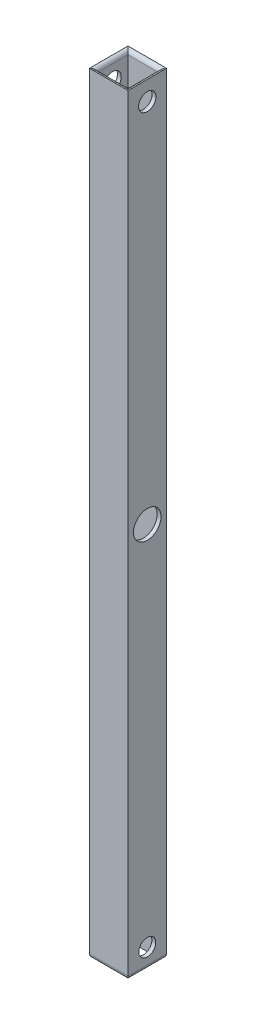
ISO-10303-21;
HEADER;
FILE_DESCRIPTION(('STEP AP214'),'2;1');
FILE_NAME('part.step','',(''),(''),'','','');
FILE_SCHEMA(('AUTOMOTIVE_DESIGN { 1 0 10303 214 1 1 1 1 }'));
ENDSEC;
DATA;
#1=APPLICATION_CONTEXT('core data for automotive mechanical design processes');
#2=APPLICATION_PROTOCOL_DEFINITION('international standard','automotive_design',2000,#1);
#3=PRODUCT_CONTEXT('',#1,'mechanical');
#4=PRODUCT('Part','Part','',(#3));
#5=PRODUCT_RELATED_PRODUCT_CATEGORY('part','',(#4));
#6=PRODUCT_DEFINITION_FORMATION('','',#4);
#7=PRODUCT_DEFINITION_CONTEXT('part definition',#1,'design');
#8=PRODUCT_DEFINITION('design','',#6,#7);
#9=PRODUCT_DEFINITION_SHAPE('','',#8);
#10=(LENGTH_UNIT() NAMED_UNIT(*) SI_UNIT(.MILLI.,.METRE.));
#11=(NAMED_UNIT(*) PLANE_ANGLE_UNIT() SI_UNIT($,.RADIAN.));
#12=(NAMED_UNIT(*) SI_UNIT($,.STERADIAN.) SOLID_ANGLE_UNIT());
#13=UNCERTAINTY_MEASURE_WITH_UNIT(LENGTH_MEASURE(1.E-05),#10,'distance_accuracy_value','');
#14=(GEOMETRIC_REPRESENTATION_CONTEXT(3) GLOBAL_UNCERTAINTY_ASSIGNED_CONTEXT((#13)) GLOBAL_UNIT_ASSIGNED_CONTEXT((#10,
#11,#12)) REPRESENTATION_CONTEXT('',''));
#15=CARTESIAN_POINT('',(0.,0.,0.));
#16=DIRECTION('',(0.,0.,1.));
#17=DIRECTION('',(1.,0.,0.));
#18=AXIS2_PLACEMENT_3D('',#15,#16,#17);
#19=CARTESIAN_POINT('',(5.,200.,-5.));
#20=DIRECTION('',(-1.,0.,0.));
#21=DIRECTION('',(0.,0.,1.));
#22=AXIS2_PLACEMENT_3D('',#19,#20,#21);
#23=PLANE('',#22);
#24=CARTESIAN_POINT('',(5.,195.,0.));
#25=DIRECTION('',(1.,0.,0.));
#26=DIRECTION('',(0.,0.,-1.));
#27=AXIS2_PLACEMENT_3D('',#24,#25,#26);
#28=CIRCLE('',#27,2.25);
#29=CARTESIAN_POINT('',(5.,195.,-2.25));
#30=VERTEX_POINT('',#29);
#31=EDGE_CURVE('E587',#30,#30,#28,.T.);
#32=ORIENTED_EDGE('',*,*,#31,.F.);
#33=EDGE_LOOP('',(#32));
#34=FACE_BOUND('',#33,.T.);
#35=CARTESIAN_POINT('',(5.,5.,0.));
#36=DIRECTION('',(1.,0.,0.));
#37=DIRECTION('',(0.,0.,-1.));
#38=AXIS2_PLACEMENT_3D('',#35,#36,#37);
#39=CIRCLE('',#38,2.2);
#40=CARTESIAN_POINT('',(5.,5.,-2.2));
#41=VERTEX_POINT('',#40);
#42=EDGE_CURVE('E555',#41,#41,#39,.T.);
#43=ORIENTED_EDGE('',*,*,#42,.F.);
#44=EDGE_LOOP('',(#43));
#45=FACE_BOUND('',#44,.T.);
#46=CARTESIAN_POINT('',(5.,100.,0.));
#47=DIRECTION('',(1.,0.,0.));
#48=DIRECTION('',(0.,0.,-1.));
#49=AXIS2_PLACEMENT_3D('',#46,#47,#48);
#50=CIRCLE('',#49,3.575);
#51=CARTESIAN_POINT('',(5.,100.,-3.575));
#52=VERTEX_POINT('',#51);
#53=EDGE_CURVE('E550',#52,#52,#50,.T.);
#54=ORIENTED_EDGE('',*,*,#53,.F.);
#55=EDGE_LOOP('',(#54));
#56=FACE_BOUND('',#55,.T.);
#57=DIRECTION('',(0.,-1.,0.));
#58=VECTOR('',#57,1.);
#59=CARTESIAN_POINT('',(5.,200.,5.));
#60=LINE('',#59,#58);
#61=CARTESIAN_POINT('',(5.,200.,5.));
#62=VERTEX_POINT('',#61);
#63=CARTESIAN_POINT('',(5.,1.,5.));
#64=VERTEX_POINT('',#63);
#65=EDGE_CURVE('E208',#62,#64,#60,.T.);
#66=ORIENTED_EDGE('',*,*,#65,.T.);
#67=DIRECTION('',(0.,0.,-1.));
#68=VECTOR('',#67,1.);
#69=CARTESIAN_POINT('',(5.,1.,-5.));
#70=LINE('',#69,#68);
#71=CARTESIAN_POINT('',(5.,1.,-5.));
#72=VERTEX_POINT('',#71);
#73=EDGE_CURVE('E228',#64,#72,#70,.T.);
#74=ORIENTED_EDGE('',*,*,#73,.T.);
#75=DIRECTION('',(0.,-1.,0.));
#76=VECTOR('',#75,1.);
#77=CARTESIAN_POINT('',(5.,200.,-5.));
#78=LINE('',#77,#76);
#79=CARTESIAN_POINT('',(5.,200.,-5.));
#80=VERTEX_POINT('',#79);
#81=EDGE_CURVE('E224',#80,#72,#78,.T.);
#82=ORIENTED_EDGE('',*,*,#81,.F.);
#83=DIRECTION('',(0.,0.,-1.));
#84=VECTOR('',#83,1.);
#85=CARTESIAN_POINT('',(5.,200.,-5.));
#86=LINE('',#85,#84);
#87=EDGE_CURVE('E210',#62,#80,#86,.T.);
#88=ORIENTED_EDGE('',*,*,#87,.F.);
#89=EDGE_LOOP('',(#66,#74,#82,#88));
#90=FACE_BOUND('',#89,.T.);
#91=ADVANCED_FACE('F54',(#34,#45,#56,#90),#23,.F.);
#92=CARTESIAN_POINT('',(-5.,200.,-5.));
#93=DIRECTION('',(0.,0.,1.));
#94=DIRECTION('',(1.,0.,0.));
#95=AXIS2_PLACEMENT_3D('',#92,#93,#94);
#96=PLANE('',#95);
#97=ORIENTED_EDGE('',*,*,#81,.T.);
#98=DIRECTION('',(-1.,0.,0.));
#99=VECTOR('',#98,1.);
#100=CARTESIAN_POINT('',(-5.,1.,-5.));
#101=LINE('',#100,#99);
#102=CARTESIAN_POINT('',(-5.,1.,-5.));
#103=VERTEX_POINT('',#102);
#104=EDGE_CURVE('E157',#72,#103,#101,.T.);
#105=ORIENTED_EDGE('',*,*,#104,.T.);
#106=DIRECTION('',(0.,-1.,0.));
#107=VECTOR('',#106,1.);
#108=CARTESIAN_POINT('',(-5.,200.,-5.));
#109=LINE('',#108,#107);
#110=CARTESIAN_POINT('',(-5.,200.,-5.));
#111=VERTEX_POINT('',#110);
#112=EDGE_CURVE('E221',#111,#103,#109,.T.);
#113=ORIENTED_EDGE('',*,*,#112,.F.);
#114=DIRECTION('',(-1.,0.,0.));
#115=VECTOR('',#114,1.);
#116=CARTESIAN_POINT('',(-5.,200.,-5.));
#117=LINE('',#116,#115);
#118=EDGE_CURVE('E203',#80,#111,#117,.T.);
#119=ORIENTED_EDGE('',*,*,#118,.F.);
#120=EDGE_LOOP('',(#97,#105,#113,#119));
#121=FACE_BOUND('',#120,.T.);
#122=ADVANCED_FACE('F275',(#121),#96,.F.);
#123=CARTESIAN_POINT('',(-5.,200.,-5.));
#124=DIRECTION('',(1.,0.,0.));
#125=DIRECTION('',(0.,0.,-1.));
#126=AXIS2_PLACEMENT_3D('',#123,#124,#125);
#127=PLANE('',#126);
#128=CARTESIAN_POINT('',(-5.,195.,0.));
#129=DIRECTION('',(1.,0.,0.));
#130=DIRECTION('',(0.,0.,-1.));
#131=AXIS2_PLACEMENT_3D('',#128,#129,#130);
#132=CIRCLE('',#131,2.25);
#133=CARTESIAN_POINT('',(-5.,195.,-2.25));
#134=VERTEX_POINT('',#133);
#135=EDGE_CURVE('E176',#134,#134,#132,.T.);
#136=ORIENTED_EDGE('',*,*,#135,.T.);
#137=EDGE_LOOP('',(#136));
#138=FACE_BOUND('',#137,.T.);
#139=CARTESIAN_POINT('',(-5.,5.,0.));
#140=DIRECTION('',(1.,0.,0.));
#141=DIRECTION('',(0.,0.,-1.));
#142=AXIS2_PLACEMENT_3D('',#139,#140,#141);
#143=CIRCLE('',#142,2.2);
#144=CARTESIAN_POINT('',(-5.,5.,-2.2));
#145=VERTEX_POINT('',#144);
#146=EDGE_CURVE('E582',#145,#145,#143,.T.);
#147=ORIENTED_EDGE('',*,*,#146,.T.);
#148=EDGE_LOOP('',(#147));
#149=FACE_BOUND('',#148,.T.);
#150=CARTESIAN_POINT('',(-5.,100.,0.));
#151=DIRECTION('',(1.,0.,0.));
#152=DIRECTION('',(0.,0.,-1.));
#153=AXIS2_PLACEMENT_3D('',#150,#151,#152);
#154=CIRCLE('',#153,3.575);
#155=CARTESIAN_POINT('',(-5.,100.,-3.575));
#156=VERTEX_POINT('',#155);
#157=EDGE_CURVE('E234',#156,#156,#154,.T.);
#158=ORIENTED_EDGE('',*,*,#157,.T.);
#159=EDGE_LOOP('',(#158));
#160=FACE_BOUND('',#159,.T.);
#161=ORIENTED_EDGE('',*,*,#112,.T.);
#162=DIRECTION('',(0.,0.,1.));
#163=VECTOR('',#162,1.);
#164=CARTESIAN_POINT('',(-5.,1.,-5.));
#165=LINE('',#164,#163);
#166=CARTESIAN_POINT('',(-5.,1.,5.));
#167=VERTEX_POINT('',#166);
#168=EDGE_CURVE('E248',#103,#167,#165,.T.);
#169=ORIENTED_EDGE('',*,*,#168,.T.);
#170=DIRECTION('',(0.,-1.,0.));
#171=VECTOR('',#170,1.);
#172=CARTESIAN_POINT('',(-5.,200.,5.));
#173=LINE('',#172,#171);
#174=CARTESIAN_POINT('',(-5.,200.,5.));
#175=VERTEX_POINT('',#174);
#176=EDGE_CURVE('E217',#175,#167,#173,.T.);
#177=ORIENTED_EDGE('',*,*,#176,.F.);
#178=DIRECTION('',(0.,0.,1.));
#179=VECTOR('',#178,1.);
#180=CARTESIAN_POINT('',(-5.,200.,-5.));
#181=LINE('',#180,#179);
#182=EDGE_CURVE('E198',#111,#175,#181,.T.);
#183=ORIENTED_EDGE('',*,*,#182,.F.);
#184=EDGE_LOOP('',(#161,#169,#177,#183));
#185=FACE_BOUND('',#184,.T.);
#186=ADVANCED_FACE('F303',(#138,#149,#160,#185),#127,.F.);
#187=CARTESIAN_POINT('',(-5.,200.,5.));
#188=DIRECTION('',(0.,0.,-1.));
#189=DIRECTION('',(-1.,0.,0.));
#190=AXIS2_PLACEMENT_3D('',#187,#188,#189);
#191=PLANE('',#190);
#192=ORIENTED_EDGE('',*,*,#176,.T.);
#193=DIRECTION('',(1.,0.,0.));
#194=VECTOR('',#193,1.);
#195=CARTESIAN_POINT('',(-5.,1.,5.));
#196=LINE('',#195,#194);
#197=EDGE_CURVE('E251',#167,#64,#196,.T.);
#198=ORIENTED_EDGE('',*,*,#197,.T.);
#199=ORIENTED_EDGE('',*,*,#65,.F.);
#200=DIRECTION('',(1.,0.,0.));
#201=VECTOR('',#200,1.);
#202=CARTESIAN_POINT('',(-5.,200.,5.));
#203=LINE('',#202,#201);
#204=EDGE_CURVE('E192',#175,#62,#203,.T.);
#205=ORIENTED_EDGE('',*,*,#204,.F.);
#206=EDGE_LOOP('',(#192,#198,#199,#205));
#207=FACE_BOUND('',#206,.T.);
#208=ADVANCED_FACE('F304',(#207),#191,.F.);
#209=CARTESIAN_POINT('',(4.,0.,0.));
#210=DIRECTION('',(-1.,0.,0.));
#211=DIRECTION('',(0.,0.,1.));
#212=AXIS2_PLACEMENT_3D('',#209,#210,#211);
#213=PLANE('',#212);
#214=CARTESIAN_POINT('',(4.,195.,0.));
#215=DIRECTION('',(-1.,0.,0.));
#216=DIRECTION('',(0.,0.,1.));
#217=AXIS2_PLACEMENT_3D('',#214,#215,#216);
#218=CIRCLE('',#217,2.25);
#219=CARTESIAN_POINT('',(4.,195.,2.25));
#220=VERTEX_POINT('',#219);
#221=EDGE_CURVE('E154',#220,#220,#218,.T.);
#222=ORIENTED_EDGE('',*,*,#221,.F.);
#223=EDGE_LOOP('',(#222));
#224=FACE_BOUND('',#223,.T.);
#225=CARTESIAN_POINT('',(4.,5.,0.));
#226=DIRECTION('',(-1.,0.,0.));
#227=DIRECTION('',(0.,0.,1.));
#228=AXIS2_PLACEMENT_3D('',#225,#226,#227);
#229=CIRCLE('',#228,2.2);
#230=CARTESIAN_POINT('',(4.,5.,2.2));
#231=VERTEX_POINT('',#230);
#232=EDGE_CURVE('E239',#231,#231,#229,.T.);
#233=ORIENTED_EDGE('',*,*,#232,.F.);
#234=EDGE_LOOP('',(#233));
#235=FACE_BOUND('',#234,.T.);
#236=CARTESIAN_POINT('',(4.,100.,0.));
#237=DIRECTION('',(-1.,0.,0.));
#238=DIRECTION('',(0.,0.,1.));
#239=AXIS2_PLACEMENT_3D('',#236,#237,#238);
#240=CIRCLE('',#239,3.575);
#241=CARTESIAN_POINT('',(4.,100.,3.575));
#242=VERTEX_POINT('',#241);
#243=EDGE_CURVE('E233',#242,#242,#240,.T.);
#244=ORIENTED_EDGE('',*,*,#243,.F.);
#245=EDGE_LOOP('',(#244));
#246=FACE_BOUND('',#245,.T.);
#247=DIRECTION('',(0.,1.,0.));
#248=VECTOR('',#247,1.);
#249=CARTESIAN_POINT('',(4.,0.,4.));
#250=LINE('',#249,#248);
#251=CARTESIAN_POINT('',(4.,0.,4.));
#252=VERTEX_POINT('',#251);
#253=CARTESIAN_POINT('',(4.,199.,4.));
#254=VERTEX_POINT('',#253);
#255=EDGE_CURVE('E262',#252,#254,#250,.T.);
#256=ORIENTED_EDGE('',*,*,#255,.T.);
#257=DIRECTION('',(0.,0.,1.));
#258=VECTOR('',#257,1.);
#259=CARTESIAN_POINT('',(4.,199.,0.));
#260=LINE('',#259,#258);
#261=CARTESIAN_POINT('',(4.,199.,-4.));
#262=VERTEX_POINT('',#261);
#263=EDGE_CURVE('E141',#254,#262,#260,.F.);
#264=ORIENTED_EDGE('',*,*,#263,.T.);
#265=DIRECTION('',(0.,1.,0.));
#266=VECTOR('',#265,1.);
#267=CARTESIAN_POINT('',(4.,0.,-4.));
#268=LINE('',#267,#266);
#269=CARTESIAN_POINT('',(4.,0.,-4.));
#270=VERTEX_POINT('',#269);
#271=EDGE_CURVE('E123',#270,#262,#268,.T.);
#272=ORIENTED_EDGE('',*,*,#271,.F.);
#273=DIRECTION('',(0.,0.,1.));
#274=VECTOR('',#273,1.);
#275=CARTESIAN_POINT('',(4.,0.,0.));
#276=LINE('',#275,#274);
#277=EDGE_CURVE('E131',#270,#252,#276,.T.);
#278=ORIENTED_EDGE('',*,*,#277,.T.);
#279=EDGE_LOOP('',(#256,#264,#272,#278));
#280=FACE_BOUND('',#279,.T.);
#281=ADVANCED_FACE('F138',(#224,#235,#246,#280),#213,.T.);
#282=CARTESIAN_POINT('',(0.,0.,4.));
#283=DIRECTION('',(0.,0.,1.));
#284=DIRECTION('',(1.,0.,0.));
#285=AXIS2_PLACEMENT_3D('',#282,#283,#284);
#286=PLANE('',#285);
#287=DIRECTION('',(0.,1.,0.));
#288=VECTOR('',#287,1.);
#289=CARTESIAN_POINT('',(-4.,0.,4.));
#290=LINE('',#289,#288);
#291=CARTESIAN_POINT('',(-4.,0.,4.));
#292=VERTEX_POINT('',#291);
#293=CARTESIAN_POINT('',(-4.,199.,4.));
#294=VERTEX_POINT('',#293);
#295=EDGE_CURVE('E263',#292,#294,#290,.T.);
#296=ORIENTED_EDGE('',*,*,#295,.T.);
#297=DIRECTION('',(1.,0.,0.));
#298=VECTOR('',#297,1.);
#299=CARTESIAN_POINT('',(4.,199.,4.));
#300=LINE('',#299,#298);
#301=EDGE_CURVE('E64',#294,#254,#300,.T.);
#302=ORIENTED_EDGE('',*,*,#301,.T.);
#303=ORIENTED_EDGE('',*,*,#255,.F.);
#304=DIRECTION('',(1.,0.,0.));
#305=VECTOR('',#304,1.);
#306=CARTESIAN_POINT('',(0.,0.,4.));
#307=LINE('',#306,#305);
#308=EDGE_CURVE('E143',#292,#252,#307,.T.);
#309=ORIENTED_EDGE('',*,*,#308,.F.);
#310=EDGE_LOOP('',(#296,#302,#303,#309));
#311=FACE_BOUND('',#310,.T.);
#312=ADVANCED_FACE('F260',(#311),#286,.F.);
#313=CARTESIAN_POINT('',(-4.,0.,0.));
#314=DIRECTION('',(-1.,0.,0.));
#315=DIRECTION('',(0.,0.,1.));
#316=AXIS2_PLACEMENT_3D('',#313,#314,#315);
#317=PLANE('',#316);
#318=CARTESIAN_POINT('',(-4.,195.,0.));
#319=DIRECTION('',(-1.,0.,0.));
#320=DIRECTION('',(0.,0.,1.));
#321=AXIS2_PLACEMENT_3D('',#318,#319,#320);
#322=CIRCLE('',#321,2.25);
#323=CARTESIAN_POINT('',(-4.,195.,2.25));
#324=VERTEX_POINT('',#323);
#325=EDGE_CURVE('E240',#324,#324,#322,.T.);
#326=ORIENTED_EDGE('',*,*,#325,.T.);
#327=EDGE_LOOP('',(#326));
#328=FACE_BOUND('',#327,.T.);
#329=CARTESIAN_POINT('',(-4.,5.,0.));
#330=DIRECTION('',(-1.,0.,0.));
#331=DIRECTION('',(0.,0.,1.));
#332=AXIS2_PLACEMENT_3D('',#329,#330,#331);
#333=CIRCLE('',#332,2.2);
#334=CARTESIAN_POINT('',(-4.,5.,2.2));
#335=VERTEX_POINT('',#334);
#336=EDGE_CURVE('E235',#335,#335,#333,.T.);
#337=ORIENTED_EDGE('',*,*,#336,.T.);
#338=EDGE_LOOP('',(#337));
#339=FACE_BOUND('',#338,.T.);
#340=CARTESIAN_POINT('',(-4.,100.,0.));
#341=DIRECTION('',(-1.,0.,0.));
#342=DIRECTION('',(0.,0.,1.));
#343=AXIS2_PLACEMENT_3D('',#340,#341,#342);
#344=CIRCLE('',#343,3.575);
#345=CARTESIAN_POINT('',(-4.,100.,3.575));
#346=VERTEX_POINT('',#345);
#347=EDGE_CURVE('E229',#346,#346,#344,.T.);
#348=ORIENTED_EDGE('',*,*,#347,.T.);
#349=EDGE_LOOP('',(#348));
#350=FACE_BOUND('',#349,.T.);
#351=DIRECTION('',(0.,1.,0.));
#352=VECTOR('',#351,1.);
#353=CARTESIAN_POINT('',(-4.,0.,-4.));
#354=LINE('',#353,#352);
#355=CARTESIAN_POINT('',(-4.,0.,-4.));
#356=VERTEX_POINT('',#355);
#357=CARTESIAN_POINT('',(-4.,199.,-4.));
#358=VERTEX_POINT('',#357);
#359=EDGE_CURVE('E124',#356,#358,#354,.T.);
#360=ORIENTED_EDGE('',*,*,#359,.T.);
#361=DIRECTION('',(0.,0.,1.));
#362=VECTOR('',#361,1.);
#363=CARTESIAN_POINT('',(-4.,199.,4.));
#364=LINE('',#363,#362);
#365=EDGE_CURVE('E77',#358,#294,#364,.T.);
#366=ORIENTED_EDGE('',*,*,#365,.T.);
#367=ORIENTED_EDGE('',*,*,#295,.F.);
#368=DIRECTION('',(0.,0.,1.));
#369=VECTOR('',#368,1.);
#370=CARTESIAN_POINT('',(-4.,0.,0.));
#371=LINE('',#370,#369);
#372=EDGE_CURVE('E130',#356,#292,#371,.T.);
#373=ORIENTED_EDGE('',*,*,#372,.F.);
#374=EDGE_LOOP('',(#360,#366,#367,#373));
#375=FACE_BOUND('',#374,.T.);
#376=ADVANCED_FACE('F299',(#328,#339,#350,#375),#317,.F.);
#377=CARTESIAN_POINT('',(0.,0.,-4.));
#378=DIRECTION('',(0.,0.,1.));
#379=DIRECTION('',(1.,0.,0.));
#380=AXIS2_PLACEMENT_3D('',#377,#378,#379);
#381=PLANE('',#380);
#382=ORIENTED_EDGE('',*,*,#271,.T.);
#383=DIRECTION('',(1.,0.,0.));
#384=VECTOR('',#383,1.);
#385=CARTESIAN_POINT('',(0.,199.,-4.));
#386=LINE('',#385,#384);
#387=EDGE_CURVE('E13',#262,#358,#386,.F.);
#388=ORIENTED_EDGE('',*,*,#387,.T.);
#389=ORIENTED_EDGE('',*,*,#359,.F.);
#390=DIRECTION('',(1.,0.,0.));
#391=VECTOR('',#390,1.);
#392=CARTESIAN_POINT('',(0.,0.,-4.));
#393=LINE('',#392,#391);
#394=EDGE_CURVE('E120',#356,#270,#393,.T.);
#395=ORIENTED_EDGE('',*,*,#394,.T.);
#396=EDGE_LOOP('',(#382,#388,#389,#395));
#397=FACE_BOUND('',#396,.T.);
#398=ADVANCED_FACE('F122',(#397),#381,.T.);
#399=CARTESIAN_POINT('',(-5.,100.,0.));
#400=DIRECTION('',(1.,0.,0.));
#401=DIRECTION('',(0.,0.,-1.));
#402=AXIS2_PLACEMENT_3D('',#399,#400,#401);
#403=CYLINDRICAL_SURFACE('',#402,3.575);
#404=ORIENTED_EDGE('',*,*,#157,.F.);
#405=EDGE_LOOP('',(#404));
#406=FACE_BOUND('',#405,.T.);
#407=ORIENTED_EDGE('',*,*,#347,.F.);
#408=EDGE_LOOP('',(#407));
#409=FACE_BOUND('',#408,.T.);
#410=ADVANCED_FACE('F386',(#406,#409),#403,.F.);
#411=CARTESIAN_POINT('',(-5.,5.,0.));
#412=DIRECTION('',(1.,0.,0.));
#413=DIRECTION('',(0.,0.,-1.));
#414=AXIS2_PLACEMENT_3D('',#411,#412,#413);
#415=CYLINDRICAL_SURFACE('',#414,2.2);
#416=ORIENTED_EDGE('',*,*,#146,.F.);
#417=EDGE_LOOP('',(#416));
#418=FACE_BOUND('',#417,.T.);
#419=ORIENTED_EDGE('',*,*,#336,.F.);
#420=EDGE_LOOP('',(#419));
#421=FACE_BOUND('',#420,.T.);
#422=ADVANCED_FACE('F378',(#418,#421),#415,.F.);
#423=CARTESIAN_POINT('',(-5.,195.,0.));
#424=DIRECTION('',(1.,0.,0.));
#425=DIRECTION('',(0.,0.,-1.));
#426=AXIS2_PLACEMENT_3D('',#423,#424,#425);
#427=CYLINDRICAL_SURFACE('',#426,2.25);
#428=ORIENTED_EDGE('',*,*,#135,.F.);
#429=EDGE_LOOP('',(#428));
#430=FACE_BOUND('',#429,.T.);
#431=ORIENTED_EDGE('',*,*,#325,.F.);
#432=EDGE_LOOP('',(#431));
#433=FACE_BOUND('',#432,.T.);
#434=ADVANCED_FACE('F369',(#430,#433),#427,.F.);
#435=ORIENTED_EDGE('',*,*,#243,.T.);
#436=EDGE_LOOP('',(#435));
#437=FACE_BOUND('',#436,.T.);
#438=ORIENTED_EDGE('',*,*,#53,.T.);
#439=EDGE_LOOP('',(#438));
#440=FACE_BOUND('',#439,.T.);
#441=ADVANCED_FACE('F375',(#437,#440),#403,.F.);
#442=ORIENTED_EDGE('',*,*,#232,.T.);
#443=EDGE_LOOP('',(#442));
#444=FACE_BOUND('',#443,.T.);
#445=ORIENTED_EDGE('',*,*,#42,.T.);
#446=EDGE_LOOP('',(#445));
#447=FACE_BOUND('',#446,.T.);
#448=ADVANCED_FACE('F366',(#444,#447),#415,.F.);
#449=ORIENTED_EDGE('',*,*,#221,.T.);
#450=EDGE_LOOP('',(#449));
#451=FACE_BOUND('',#450,.T.);
#452=ORIENTED_EDGE('',*,*,#31,.T.);
#453=EDGE_LOOP('',(#452));
#454=FACE_BOUND('',#453,.T.);
#455=ADVANCED_FACE('F333',(#451,#454),#427,.F.);
#456=CARTESIAN_POINT('',(-4.,1.,-5.));
#457=DIRECTION('',(0.,0.,1.));
#458=DIRECTION('',(1.,0.,0.));
#459=AXIS2_PLACEMENT_3D('',#456,#457,#458);
#460=CYLINDRICAL_SURFACE('',#459,1.);
#461=CARTESIAN_POINT('',(-4.,1.,-4.));
#462=DIRECTION('',(-0.707106781186547,0.,0.707106781186547));
#463=DIRECTION('',(0.707106781186547,0.,0.707106781186547));
#464=AXIS2_PLACEMENT_3D('',#461,#462,#463);
#465=ELLIPSE('',#464,1.41421356237309,1.);
#466=EDGE_CURVE('E164',#356,#103,#465,.F.);
#467=ORIENTED_EDGE('',*,*,#466,.F.);
#468=ORIENTED_EDGE('',*,*,#372,.T.);
#469=CARTESIAN_POINT('',(-4.,1.,4.));
#470=DIRECTION('',(0.707106781186547,0.,0.707106781186547));
#471=DIRECTION('',(0.707106781186547,0.,-0.707106781186547));
#472=AXIS2_PLACEMENT_3D('',#469,#470,#471);
#473=ELLIPSE('',#472,1.41421356237309,1.);
#474=EDGE_CURVE('E172',#167,#292,#473,.T.);
#475=ORIENTED_EDGE('',*,*,#474,.F.);
#476=ORIENTED_EDGE('',*,*,#168,.F.);
#477=EDGE_LOOP('',(#467,#468,#475,#476));
#478=FACE_BOUND('',#477,.T.);
#479=ADVANCED_FACE('F301',(#478),#460,.T.);
#480=CARTESIAN_POINT('',(-5.,1.,4.));
#481=DIRECTION('',(1.,0.,0.));
#482=DIRECTION('',(0.,0.,-1.));
#483=AXIS2_PLACEMENT_3D('',#480,#481,#482);
#484=CYLINDRICAL_SURFACE('',#483,1.);
#485=ORIENTED_EDGE('',*,*,#474,.T.);
#486=ORIENTED_EDGE('',*,*,#308,.T.);
#487=CARTESIAN_POINT('',(4.,1.,4.));
#488=DIRECTION('',(0.707106781186547,0.,-0.707106781186548));
#489=DIRECTION('',(0.707106781186547,0.,0.707106781186547));
#490=AXIS2_PLACEMENT_3D('',#487,#488,#489);
#491=ELLIPSE('',#490,1.4142135623731,1.);
#492=EDGE_CURVE('E151',#64,#252,#491,.T.);
#493=ORIENTED_EDGE('',*,*,#492,.F.);
#494=ORIENTED_EDGE('',*,*,#197,.F.);
#495=EDGE_LOOP('',(#485,#486,#493,#494));
#496=FACE_BOUND('',#495,.T.);
#497=ADVANCED_FACE('F280',(#496),#484,.T.);
#498=CARTESIAN_POINT('',(-5.,1.,-4.));
#499=DIRECTION('',(-1.,0.,0.));
#500=DIRECTION('',(0.,0.,1.));
#501=AXIS2_PLACEMENT_3D('',#498,#499,#500);
#502=CYLINDRICAL_SURFACE('',#501,1.);
#503=ORIENTED_EDGE('',*,*,#466,.T.);
#504=ORIENTED_EDGE('',*,*,#104,.F.);
#505=CARTESIAN_POINT('',(4.,1.,-4.));
#506=DIRECTION('',(-0.707106781186547,0.,-0.707106781186547));
#507=DIRECTION('',(-0.707106781186547,0.,0.707106781186548));
#508=AXIS2_PLACEMENT_3D('',#505,#506,#507);
#509=ELLIPSE('',#508,1.41421356237309,1.);
#510=EDGE_CURVE('E148',#270,#72,#509,.F.);
#511=ORIENTED_EDGE('',*,*,#510,.F.);
#512=ORIENTED_EDGE('',*,*,#394,.F.);
#513=EDGE_LOOP('',(#503,#504,#511,#512));
#514=FACE_BOUND('',#513,.T.);
#515=ADVANCED_FACE('F156',(#514),#502,.T.);
#516=CARTESIAN_POINT('',(4.,1.,-5.));
#517=DIRECTION('',(0.,0.,-1.));
#518=DIRECTION('',(-1.,0.,0.));
#519=AXIS2_PLACEMENT_3D('',#516,#517,#518);
#520=CYLINDRICAL_SURFACE('',#519,1.);
#521=ORIENTED_EDGE('',*,*,#492,.T.);
#522=ORIENTED_EDGE('',*,*,#277,.F.);
#523=ORIENTED_EDGE('',*,*,#510,.T.);
#524=ORIENTED_EDGE('',*,*,#73,.F.);
#525=EDGE_LOOP('',(#521,#522,#523,#524));
#526=FACE_BOUND('',#525,.T.);
#527=ADVANCED_FACE('F146',(#526),#520,.T.);
#528=CARTESIAN_POINT('',(-5.,199.,0.));
#529=DIRECTION('',(0.,0.,-1.));
#530=DIRECTION('',(-1.,0.,0.));
#531=AXIS2_PLACEMENT_3D('',#528,#529,#530);
#532=CYLINDRICAL_SURFACE('',#531,1.);
#533=CARTESIAN_POINT('',(-5.,199.,5.));
#534=DIRECTION('',(-0.707106781186548,0.,-0.707106781186547));
#535=DIRECTION('',(0.707106781186547,0.,-0.707106781186547));
#536=AXIS2_PLACEMENT_3D('',#533,#534,#535);
#537=ELLIPSE('',#536,1.4142135623731,1.);
#538=EDGE_CURVE('E167',#294,#175,#537,.F.);
#539=ORIENTED_EDGE('',*,*,#538,.F.);
#540=ORIENTED_EDGE('',*,*,#365,.F.);
#541=CARTESIAN_POINT('',(-5.,199.,-5.));
#542=DIRECTION('',(0.707106781186547,0.,-0.707106781186547));
#543=DIRECTION('',(-0.707106781186547,0.,-0.707106781186547));
#544=AXIS2_PLACEMENT_3D('',#541,#542,#543);
#545=ELLIPSE('',#544,1.41421356237309,1.);
#546=EDGE_CURVE('E58',#111,#358,#545,.T.);
#547=ORIENTED_EDGE('',*,*,#546,.F.);
#548=ORIENTED_EDGE('',*,*,#182,.T.);
#549=EDGE_LOOP('',(#539,#540,#547,#548));
#550=FACE_BOUND('',#549,.T.);
#551=ADVANCED_FACE('F56',(#550),#532,.T.);
#552=CARTESIAN_POINT('',(0.,199.,-5.));
#553=DIRECTION('',(1.,0.,0.));
#554=DIRECTION('',(0.,0.,-1.));
#555=AXIS2_PLACEMENT_3D('',#552,#553,#554);
#556=CYLINDRICAL_SURFACE('',#555,1.);
#557=ORIENTED_EDGE('',*,*,#546,.T.);
#558=ORIENTED_EDGE('',*,*,#387,.F.);
#559=CARTESIAN_POINT('',(5.,199.,-5.));
#560=DIRECTION('',(0.707106781186547,0.,0.707106781186547));
#561=DIRECTION('',(-0.707106781186547,0.,0.707106781186547));
#562=AXIS2_PLACEMENT_3D('',#559,#560,#561);
#563=ELLIPSE('',#562,1.41421356237309,1.);
#564=EDGE_CURVE('E180',#80,#262,#563,.T.);
#565=ORIENTED_EDGE('',*,*,#564,.F.);
#566=ORIENTED_EDGE('',*,*,#118,.T.);
#567=EDGE_LOOP('',(#557,#558,#565,#566));
#568=FACE_BOUND('',#567,.T.);
#569=ADVANCED_FACE('F272',(#568),#556,.T.);
#570=CARTESIAN_POINT('',(0.,199.,5.));
#571=DIRECTION('',(-1.,0.,0.));
#572=DIRECTION('',(0.,0.,1.));
#573=AXIS2_PLACEMENT_3D('',#570,#571,#572);
#574=CYLINDRICAL_SURFACE('',#573,1.);
#575=ORIENTED_EDGE('',*,*,#538,.T.);
#576=ORIENTED_EDGE('',*,*,#204,.T.);
#577=CARTESIAN_POINT('',(5.,199.,5.));
#578=DIRECTION('',(-0.707106781186547,0.,0.707106781186547));
#579=DIRECTION('',(0.707106781186548,0.,0.707106781186547));
#580=AXIS2_PLACEMENT_3D('',#577,#578,#579);
#581=ELLIPSE('',#580,1.41421356237309,1.);
#582=EDGE_CURVE('E177',#254,#62,#581,.F.);
#583=ORIENTED_EDGE('',*,*,#582,.F.);
#584=ORIENTED_EDGE('',*,*,#301,.F.);
#585=EDGE_LOOP('',(#575,#576,#583,#584));
#586=FACE_BOUND('',#585,.T.);
#587=ADVANCED_FACE('F189',(#586),#574,.T.);
#588=CARTESIAN_POINT('',(5.,199.,0.));
#589=DIRECTION('',(0.,0.,1.));
#590=DIRECTION('',(1.,0.,0.));
#591=AXIS2_PLACEMENT_3D('',#588,#589,#590);
#592=CYLINDRICAL_SURFACE('',#591,1.);
#593=ORIENTED_EDGE('',*,*,#564,.T.);
#594=ORIENTED_EDGE('',*,*,#263,.F.);
#595=ORIENTED_EDGE('',*,*,#582,.T.);
#596=ORIENTED_EDGE('',*,*,#87,.T.);
#597=EDGE_LOOP('',(#593,#594,#595,#596));
#598=FACE_BOUND('',#597,.T.);
#599=ADVANCED_FACE('F267',(#598),#592,.T.);
#600=CLOSED_SHELL('',(#91,#122,#186,#208,#281,#312,#376,#398,#410,#422,#434,#441,#448,#455,#479,
#497,#515,#527,#551,#569,#587,#599));
#601=MANIFOLD_SOLID_BREP('B2',#600);
#602=ADVANCED_BREP_SHAPE_REPRESENTATION('',(#18,#601),#14);
#603=SHAPE_DEFINITION_REPRESENTATION(#9,#602);
ENDSEC;
END-ISO-10303-21;
